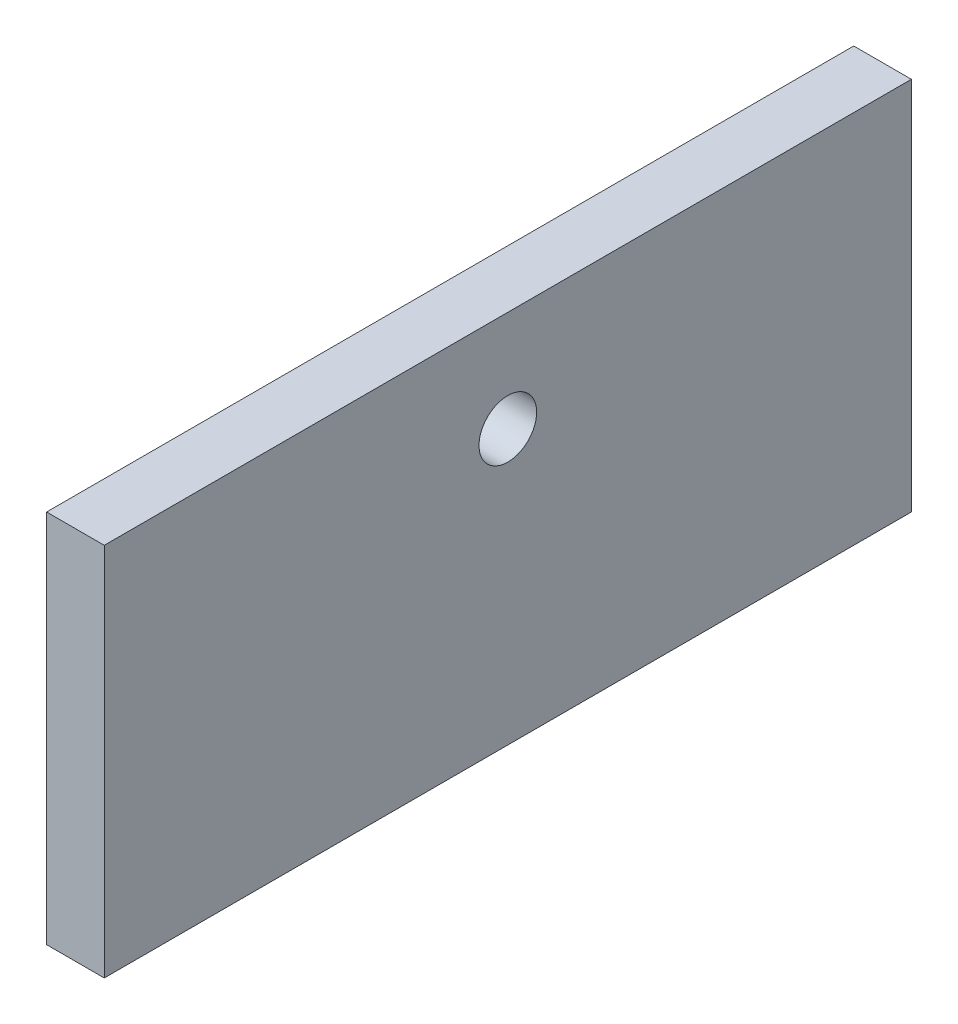
ISO-10303-21;
HEADER;
FILE_DESCRIPTION(('STEP AP214'),'2;1');
FILE_NAME('part.step','',(''),(''),'','','');
FILE_SCHEMA(('AUTOMOTIVE_DESIGN { 1 0 10303 214 1 1 1 1 }'));
ENDSEC;
DATA;
#1=APPLICATION_CONTEXT('core data for automotive mechanical design processes');
#2=APPLICATION_PROTOCOL_DEFINITION('international standard','automotive_design',2000,#1);
#3=PRODUCT_CONTEXT('',#1,'mechanical');
#4=PRODUCT('Part','Part','',(#3));
#5=PRODUCT_RELATED_PRODUCT_CATEGORY('part','',(#4));
#6=PRODUCT_DEFINITION_FORMATION('','',#4);
#7=PRODUCT_DEFINITION_CONTEXT('part definition',#1,'design');
#8=PRODUCT_DEFINITION('design','',#6,#7);
#9=PRODUCT_DEFINITION_SHAPE('','',#8);
#10=(LENGTH_UNIT() NAMED_UNIT(*) SI_UNIT(.MILLI.,.METRE.));
#11=(NAMED_UNIT(*) PLANE_ANGLE_UNIT() SI_UNIT($,.RADIAN.));
#12=(NAMED_UNIT(*) SI_UNIT($,.STERADIAN.) SOLID_ANGLE_UNIT());
#13=UNCERTAINTY_MEASURE_WITH_UNIT(LENGTH_MEASURE(1.E-05),#10,'distance_accuracy_value','');
#14=(GEOMETRIC_REPRESENTATION_CONTEXT(3) GLOBAL_UNCERTAINTY_ASSIGNED_CONTEXT((#13)) GLOBAL_UNIT_ASSIGNED_CONTEXT((#10,
#11,#12)) REPRESENTATION_CONTEXT('',''));
#15=CARTESIAN_POINT('',(0.,0.,0.));
#16=DIRECTION('',(0.,0.,1.));
#17=DIRECTION('',(1.,0.,0.));
#18=AXIS2_PLACEMENT_3D('',#15,#16,#17);
#19=CARTESIAN_POINT('',(10.,0.,0.));
#20=DIRECTION('',(1.,0.,0.));
#21=DIRECTION('',(0.,0.,-1.));
#22=AXIS2_PLACEMENT_3D('',#19,#20,#21);
#23=PLANE('',#22);
#24=DIRECTION('',(0.,-1.,0.));
#25=VECTOR('',#24,1.);
#26=CARTESIAN_POINT('',(10.,-32.5,70.));
#27=LINE('',#26,#25);
#28=CARTESIAN_POINT('',(10.,32.5,70.));
#29=VERTEX_POINT('',#28);
#30=CARTESIAN_POINT('',(10.,-32.5,70.));
#31=VERTEX_POINT('',#30);
#32=EDGE_CURVE('E85',#29,#31,#27,.T.);
#33=ORIENTED_EDGE('',*,*,#32,.T.);
#34=DIRECTION('',(0.,0.,-1.));
#35=VECTOR('',#34,1.);
#36=CARTESIAN_POINT('',(10.,-32.5,-70.));
#37=LINE('',#36,#35);
#38=CARTESIAN_POINT('',(10.,-32.5,-70.));
#39=VERTEX_POINT('',#38);
#40=EDGE_CURVE('E80',#31,#39,#37,.T.);
#41=ORIENTED_EDGE('',*,*,#40,.T.);
#42=DIRECTION('',(0.,1.,0.));
#43=VECTOR('',#42,1.);
#44=CARTESIAN_POINT('',(10.,-32.5,-70.));
#45=LINE('',#44,#43);
#46=CARTESIAN_POINT('',(10.,32.5,-70.));
#47=VERTEX_POINT('',#46);
#48=EDGE_CURVE('E83',#39,#47,#45,.T.);
#49=ORIENTED_EDGE('',*,*,#48,.T.);
#50=DIRECTION('',(0.,0.,1.));
#51=VECTOR('',#50,1.);
#52=CARTESIAN_POINT('',(10.,32.5,-70.));
#53=LINE('',#52,#51);
#54=EDGE_CURVE('E50',#47,#29,#53,.T.);
#55=ORIENTED_EDGE('',*,*,#54,.T.);
#56=EDGE_LOOP('',(#33,#41,#49,#55));
#57=FACE_BOUND('',#56,.T.);
#58=CARTESIAN_POINT('',(10.,15.,0.));
#59=DIRECTION('',(1.,0.,0.));
#60=DIRECTION('',(0.,0.,-1.));
#61=AXIS2_PLACEMENT_3D('',#58,#59,#60);
#62=CIRCLE('',#61,5.);
#63=CARTESIAN_POINT('',(10.,15.,-5.));
#64=VERTEX_POINT('',#63);
#65=EDGE_CURVE('E100',#64,#64,#62,.T.);
#66=ORIENTED_EDGE('',*,*,#65,.F.);
#67=EDGE_LOOP('',(#66));
#68=FACE_BOUND('',#67,.T.);
#69=ADVANCED_FACE('F33',(#57,#68),#23,.T.);
#70=CARTESIAN_POINT('',(0.,0.,0.));
#71=DIRECTION('',(1.,0.,0.));
#72=DIRECTION('',(0.,0.,-1.));
#73=AXIS2_PLACEMENT_3D('',#70,#71,#72);
#74=PLANE('',#73);
#75=DIRECTION('',(0.,-1.,0.));
#76=VECTOR('',#75,1.);
#77=CARTESIAN_POINT('',(0.,-32.5,70.));
#78=LINE('',#77,#76);
#79=CARTESIAN_POINT('',(0.,32.5,70.));
#80=VERTEX_POINT('',#79);
#81=CARTESIAN_POINT('',(0.,-32.5,70.));
#82=VERTEX_POINT('',#81);
#83=EDGE_CURVE('E97',#80,#82,#78,.T.);
#84=ORIENTED_EDGE('',*,*,#83,.F.);
#85=DIRECTION('',(0.,0.,1.));
#86=VECTOR('',#85,1.);
#87=CARTESIAN_POINT('',(0.,32.5,-70.));
#88=LINE('',#87,#86);
#89=CARTESIAN_POINT('',(0.,32.5,-70.));
#90=VERTEX_POINT('',#89);
#91=EDGE_CURVE('E73',#90,#80,#88,.T.);
#92=ORIENTED_EDGE('',*,*,#91,.F.);
#93=DIRECTION('',(0.,1.,0.));
#94=VECTOR('',#93,1.);
#95=CARTESIAN_POINT('',(0.,-32.5,-70.));
#96=LINE('',#95,#94);
#97=CARTESIAN_POINT('',(0.,-32.5,-70.));
#98=VERTEX_POINT('',#97);
#99=EDGE_CURVE('E67',#98,#90,#96,.T.);
#100=ORIENTED_EDGE('',*,*,#99,.F.);
#101=DIRECTION('',(0.,0.,-1.));
#102=VECTOR('',#101,1.);
#103=CARTESIAN_POINT('',(0.,-32.5,-70.));
#104=LINE('',#103,#102);
#105=EDGE_CURVE('E89',#82,#98,#104,.T.);
#106=ORIENTED_EDGE('',*,*,#105,.F.);
#107=EDGE_LOOP('',(#84,#92,#100,#106));
#108=FACE_BOUND('',#107,.T.);
#109=CARTESIAN_POINT('',(0.,15.,0.));
#110=DIRECTION('',(1.,0.,0.));
#111=DIRECTION('',(0.,0.,-1.));
#112=AXIS2_PLACEMENT_3D('',#109,#110,#111);
#113=CIRCLE('',#112,5.);
#114=CARTESIAN_POINT('',(0.,15.,-5.));
#115=VERTEX_POINT('',#114);
#116=EDGE_CURVE('E112',#115,#115,#113,.T.);
#117=ORIENTED_EDGE('',*,*,#116,.T.);
#118=EDGE_LOOP('',(#117));
#119=FACE_BOUND('',#118,.T.);
#120=ADVANCED_FACE('F108',(#108,#119),#74,.F.);
#121=CARTESIAN_POINT('',(10.,-32.5,70.));
#122=DIRECTION('',(0.,0.,-1.));
#123=DIRECTION('',(-1.,0.,0.));
#124=AXIS2_PLACEMENT_3D('',#121,#122,#123);
#125=PLANE('',#124);
#126=ORIENTED_EDGE('',*,*,#83,.T.);
#127=DIRECTION('',(-1.,0.,0.));
#128=VECTOR('',#127,1.);
#129=CARTESIAN_POINT('',(10.,-32.5,70.));
#130=LINE('',#129,#128);
#131=EDGE_CURVE('E11',#31,#82,#130,.T.);
#132=ORIENTED_EDGE('',*,*,#131,.F.);
#133=ORIENTED_EDGE('',*,*,#32,.F.);
#134=DIRECTION('',(-1.,0.,0.));
#135=VECTOR('',#134,1.);
#136=CARTESIAN_POINT('',(10.,32.5,70.));
#137=LINE('',#136,#135);
#138=EDGE_CURVE('E93',#29,#80,#137,.T.);
#139=ORIENTED_EDGE('',*,*,#138,.T.);
#140=EDGE_LOOP('',(#126,#132,#133,#139));
#141=FACE_BOUND('',#140,.T.);
#142=ADVANCED_FACE('F35',(#141),#125,.F.);
#143=CARTESIAN_POINT('',(10.,-32.5,-70.));
#144=DIRECTION('',(0.,1.,0.));
#145=DIRECTION('',(0.,0.,1.));
#146=AXIS2_PLACEMENT_3D('',#143,#144,#145);
#147=PLANE('',#146);
#148=ORIENTED_EDGE('',*,*,#105,.T.);
#149=DIRECTION('',(-1.,0.,0.));
#150=VECTOR('',#149,1.);
#151=CARTESIAN_POINT('',(10.,-32.5,-70.));
#152=LINE('',#151,#150);
#153=EDGE_CURVE('E42',#39,#98,#152,.T.);
#154=ORIENTED_EDGE('',*,*,#153,.F.);
#155=ORIENTED_EDGE('',*,*,#40,.F.);
#156=ORIENTED_EDGE('',*,*,#131,.T.);
#157=EDGE_LOOP('',(#148,#154,#155,#156));
#158=FACE_BOUND('',#157,.T.);
#159=ADVANCED_FACE('F88',(#158),#147,.F.);
#160=CARTESIAN_POINT('',(10.,-32.5,-70.));
#161=DIRECTION('',(0.,0.,1.));
#162=DIRECTION('',(1.,0.,0.));
#163=AXIS2_PLACEMENT_3D('',#160,#161,#162);
#164=PLANE('',#163);
#165=ORIENTED_EDGE('',*,*,#99,.T.);
#166=DIRECTION('',(-1.,0.,0.));
#167=VECTOR('',#166,1.);
#168=CARTESIAN_POINT('',(10.,32.5,-70.));
#169=LINE('',#168,#167);
#170=EDGE_CURVE('E90',#47,#90,#169,.T.);
#171=ORIENTED_EDGE('',*,*,#170,.F.);
#172=ORIENTED_EDGE('',*,*,#48,.F.);
#173=ORIENTED_EDGE('',*,*,#153,.T.);
#174=EDGE_LOOP('',(#165,#171,#172,#173));
#175=FACE_BOUND('',#174,.T.);
#176=ADVANCED_FACE('F91',(#175),#164,.F.);
#177=CARTESIAN_POINT('',(10.,32.5,-70.));
#178=DIRECTION('',(0.,-1.,0.));
#179=DIRECTION('',(0.,0.,-1.));
#180=AXIS2_PLACEMENT_3D('',#177,#178,#179);
#181=PLANE('',#180);
#182=ORIENTED_EDGE('',*,*,#91,.T.);
#183=ORIENTED_EDGE('',*,*,#138,.F.);
#184=ORIENTED_EDGE('',*,*,#54,.F.);
#185=ORIENTED_EDGE('',*,*,#170,.T.);
#186=EDGE_LOOP('',(#182,#183,#184,#185));
#187=FACE_BOUND('',#186,.T.);
#188=ADVANCED_FACE('F105',(#187),#181,.F.);
#189=CARTESIAN_POINT('',(10.,15.,0.));
#190=DIRECTION('',(-1.,0.,0.));
#191=DIRECTION('',(0.,0.,1.));
#192=AXIS2_PLACEMENT_3D('',#189,#190,#191);
#193=CYLINDRICAL_SURFACE('',#192,5.);
#194=ORIENTED_EDGE('',*,*,#65,.T.);
#195=EDGE_LOOP('',(#194));
#196=FACE_BOUND('',#195,.T.);
#197=ORIENTED_EDGE('',*,*,#116,.F.);
#198=EDGE_LOOP('',(#197));
#199=FACE_BOUND('',#198,.T.);
#200=ADVANCED_FACE('F118',(#196,#199),#193,.F.);
#201=CLOSED_SHELL('',(#69,#120,#142,#159,#176,#188,#200));
#202=MANIFOLD_SOLID_BREP('B2',#201);
#203=ADVANCED_BREP_SHAPE_REPRESENTATION('',(#18,#202),#14);
#204=SHAPE_DEFINITION_REPRESENTATION(#9,#203);
ENDSEC;
END-ISO-10303-21;
